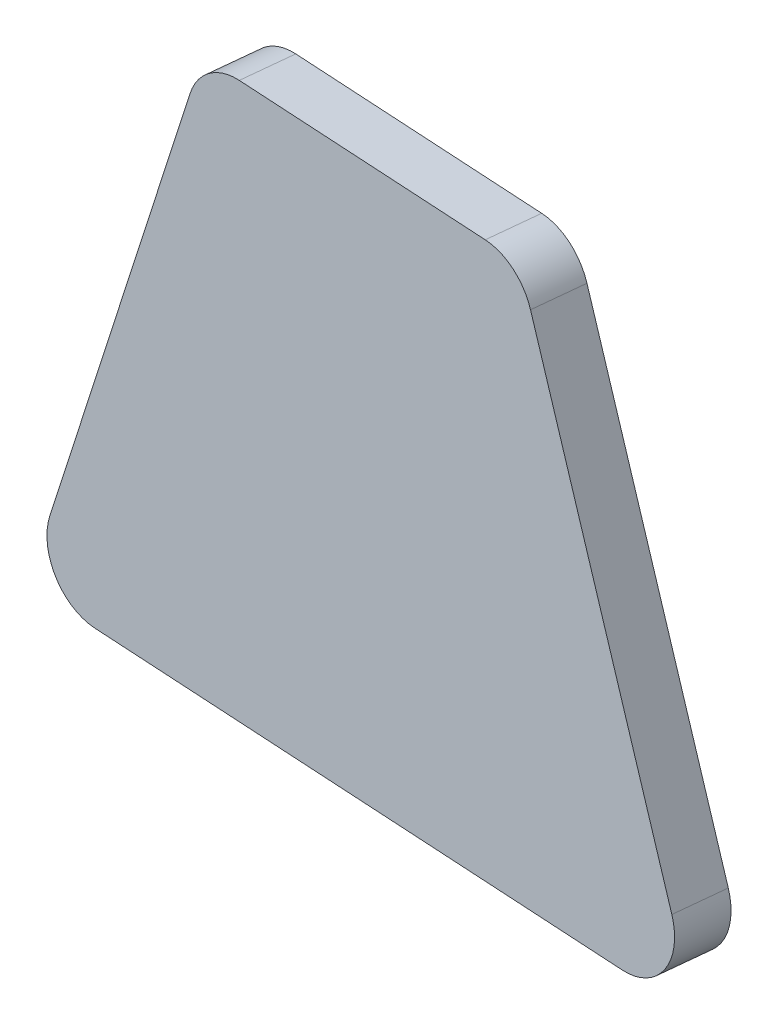
ISO-10303-21;
HEADER;
FILE_DESCRIPTION(('STEP AP214'),'2;1');
FILE_NAME('part.step','',(''),(''),'','','');
FILE_SCHEMA(('AUTOMOTIVE_DESIGN { 1 0 10303 214 1 1 1 1 }'));
ENDSEC;
DATA;
#1=APPLICATION_CONTEXT('core data for automotive mechanical design processes');
#2=APPLICATION_PROTOCOL_DEFINITION('international standard','automotive_design',2000,#1);
#3=PRODUCT_CONTEXT('',#1,'mechanical');
#4=PRODUCT('Part','Part','',(#3));
#5=PRODUCT_RELATED_PRODUCT_CATEGORY('part','',(#4));
#6=PRODUCT_DEFINITION_FORMATION('','',#4);
#7=PRODUCT_DEFINITION_CONTEXT('part definition',#1,'design');
#8=PRODUCT_DEFINITION('design','',#6,#7);
#9=PRODUCT_DEFINITION_SHAPE('','',#8);
#10=(LENGTH_UNIT() NAMED_UNIT(*) SI_UNIT(.MILLI.,.METRE.));
#11=(NAMED_UNIT(*) PLANE_ANGLE_UNIT() SI_UNIT($,.RADIAN.));
#12=(NAMED_UNIT(*) SI_UNIT($,.STERADIAN.) SOLID_ANGLE_UNIT());
#13=UNCERTAINTY_MEASURE_WITH_UNIT(LENGTH_MEASURE(1.E-05),#10,'distance_accuracy_value','');
#14=(GEOMETRIC_REPRESENTATION_CONTEXT(3) GLOBAL_UNCERTAINTY_ASSIGNED_CONTEXT((#13)) GLOBAL_UNIT_ASSIGNED_CONTEXT((#10,
#11,#12)) REPRESENTATION_CONTEXT('',''));
#15=CARTESIAN_POINT('',(0.,0.,0.));
#16=DIRECTION('',(0.,0.,1.));
#17=DIRECTION('',(1.,0.,0.));
#18=AXIS2_PLACEMENT_3D('',#15,#16,#17);
#19=CARTESIAN_POINT('',(-7.81574971739622,505.230219387593,117.441901297829));
#20=DIRECTION('',(0.,-0.999240415928223,0.0389691053989239));
#21=DIRECTION('',(0.,-0.0389691053989239,-0.999240415928223));
#22=AXIS2_PLACEMENT_3D('',#19,#20,#21);
#23=PLANE('',#22);
#24=DIRECTION('',(-0.998202841848732,-0.00233524994547634,-0.059880156419361));
#25=VECTOR('',#24,1.);
#26=CARTESIAN_POINT('',(-7.66353850287695,505.131415745339,114.90839195574));
#27=LINE('',#26,#25);
#28=CARTESIAN_POINT('',(6.65709224111823,505.164918206725,115.767457441254));
#29=VERTEX_POINT('',#28);
#30=CARTESIAN_POINT('',(-5.79189953125388,505.135794359207,115.020667767512));
#31=VERTEX_POINT('',#30);
#32=EDGE_CURVE('E129',#29,#31,#27,.T.);
#33=ORIENTED_EDGE('',*,*,#32,.T.);
#34=DIRECTION('',(0.0599256750075872,-0.0388990717535084,-0.997444622869661));
#35=VECTOR('',#34,1.);
#36=CARTESIAN_POINT('',(-5.94411074577315,505.234598001461,117.554177109601));
#37=LINE('',#36,#35);
#38=CARTESIAN_POINT('',(-5.94411074577315,505.234598001461,117.554177109601));
#39=VERTEX_POINT('',#38);
#40=EDGE_CURVE('E107',#31,#39,#37,.F.);
#41=ORIENTED_EDGE('',*,*,#40,.T.);
#42=DIRECTION('',(-0.998202841848732,-0.00233524994547634,-0.059880156419361));
#43=VECTOR('',#42,1.);
#44=CARTESIAN_POINT('',(-7.81574971739622,505.230219387593,117.441901297829));
#45=LINE('',#44,#43);
#46=CARTESIAN_POINT('',(6.50488102659895,505.263721848979,118.300966783343));
#47=VERTEX_POINT('',#46);
#48=EDGE_CURVE('E138',#47,#39,#45,.T.);
#49=ORIENTED_EDGE('',*,*,#48,.F.);
#50=DIRECTION('',(0.0599256750075872,-0.0388990717535084,-0.997444622869661));
#51=VECTOR('',#50,1.);
#52=CARTESIAN_POINT('',(6.50488102659895,505.263721848979,118.300966783343));
#53=LINE('',#52,#51);
#54=EDGE_CURVE('E112',#47,#29,#53,.T.);
#55=ORIENTED_EDGE('',*,*,#54,.T.);
#56=EDGE_LOOP('',(#33,#41,#49,#55));
#57=FACE_BOUND('',#56,.T.);
#58=ADVANCED_FACE('F36',(#57),#23,.F.);
#59=CARTESIAN_POINT('',(-15.6308234320114,479.831229815094,117.962906212137));
#60=DIRECTION('',(0.953915959752052,-0.29210332779981,0.068702166040079));
#61=DIRECTION('',(0.29279513981877,0.956175196341396,0.));
#62=AXIS2_PLACEMENT_3D('',#59,#60,#61);
#63=PLANE('',#62);
#64=DIRECTION('',(-0.294029344122669,-0.955595368398671,0.019601956274846));
#65=VECTOR('',#64,1.);
#66=CARTESIAN_POINT('',(-15.6308234320114,479.831229815094,117.962906212137));
#67=LINE('',#66,#65);
#68=CARTESIAN_POINT('',(-8.36705728354336,503.438469797615,117.478655135572));
#69=VERTEX_POINT('',#68);
#70=CARTESIAN_POINT('',(-14.6191162552355,483.119278139615,117.895459067018));
#71=VERTEX_POINT('',#70);
#72=EDGE_CURVE('E122',#69,#71,#67,.T.);
#73=ORIENTED_EDGE('',*,*,#72,.F.);
#74=DIRECTION('',(0.0599256750075872,-0.0388990717535084,-0.997444622869661));
#75=VECTOR('',#74,1.);
#76=CARTESIAN_POINT('',(-8.36705728354335,503.438469797615,117.478655135572));
#77=LINE('',#76,#75);
#78=CARTESIAN_POINT('',(-8.21484606902409,503.339666155361,114.945145793483));
#79=VERTEX_POINT('',#78);
#80=EDGE_CURVE('E106',#69,#79,#77,.T.);
#81=ORIENTED_EDGE('',*,*,#80,.T.);
#82=DIRECTION('',(-0.294029344122669,-0.955595368398671,0.019601956274846));
#83=VECTOR('',#82,1.);
#84=CARTESIAN_POINT('',(-15.4786122174922,479.73242617284,115.429396870048));
#85=LINE('',#84,#83);
#86=CARTESIAN_POINT('',(-14.4669050407163,483.020474497361,115.361949724929));
#87=VERTEX_POINT('',#86);
#88=EDGE_CURVE('E119',#79,#87,#85,.T.);
#89=ORIENTED_EDGE('',*,*,#88,.T.);
#90=DIRECTION('',(0.0599256750075872,-0.0388990717535084,-0.997444622869661));
#91=VECTOR('',#90,1.);
#92=CARTESIAN_POINT('',(-14.6191162552355,483.119278139615,117.895459067018));
#93=LINE('',#92,#91);
#94=EDGE_CURVE('E124',#87,#71,#93,.F.);
#95=ORIENTED_EDGE('',*,*,#94,.T.);
#96=EDGE_LOOP('',(#73,#81,#89,#95));
#97=FACE_BOUND('',#96,.T.);
#98=ADVANCED_FACE('F118',(#97),#63,.F.);
#99=CARTESIAN_POINT('',(18.2253387080043,479.910434759697,119.993868457194));
#100=DIRECTION('',(0.,0.999240415928223,-0.0389691053989237));
#101=DIRECTION('',(0.,0.0389691053989237,0.999240415928223));
#102=AXIS2_PLACEMENT_3D('',#99,#100,#101);
#103=PLANE('',#102);
#104=DIRECTION('',(0.998202841848732,0.00233524994547187,0.0598801564193607));
#105=VECTOR('',#104,1.);
#106=CARTESIAN_POINT('',(18.3775499225235,479.811631117443,117.460359115105));
#107=LINE('',#106,#105);
#108=CARTESIAN_POINT('',(-12.0439585029461,479.740461388292,115.635434754384));
#109=VERTEX_POINT('',#108);
#110=CARTESIAN_POINT('',(14.6527729347761,479.802917171847,117.236917326219));
#111=VERTEX_POINT('',#110);
#112=EDGE_CURVE('E128',#109,#111,#107,.T.);
#113=ORIENTED_EDGE('',*,*,#112,.T.);
#114=DIRECTION('',(0.0599256750075872,-0.0388990717535084,-0.997444622869661));
#115=VECTOR('',#114,1.);
#116=CARTESIAN_POINT('',(14.5005617202568,479.901720814101,119.770426668308));
#117=LINE('',#116,#115);
#118=CARTESIAN_POINT('',(14.5005617202568,479.901720814101,119.770426668308));
#119=VERTEX_POINT('',#118);
#120=EDGE_CURVE('E11',#111,#119,#117,.F.);
#121=ORIENTED_EDGE('',*,*,#120,.T.);
#122=DIRECTION('',(0.998202841848732,0.00233524994547187,0.0598801564193607));
#123=VECTOR('',#122,1.);
#124=CARTESIAN_POINT('',(18.2253387080043,479.910434759697,119.993868457194));
#125=LINE('',#124,#123);
#126=CARTESIAN_POINT('',(-12.1961697174653,479.839265030546,118.168944096473));
#127=VERTEX_POINT('',#126);
#128=EDGE_CURVE('E164',#127,#119,#125,.T.);
#129=ORIENTED_EDGE('',*,*,#128,.F.);
#130=DIRECTION('',(0.0599256750075872,-0.0388990717535084,-0.997444622869661));
#131=VECTOR('',#130,1.);
#132=CARTESIAN_POINT('',(-12.1961697174653,479.839265030546,118.168944096473));
#133=LINE('',#132,#131);
#134=EDGE_CURVE('E44',#127,#109,#133,.T.);
#135=ORIENTED_EDGE('',*,*,#134,.T.);
#136=EDGE_LOOP('',(#113,#121,#129,#135));
#137=FACE_BOUND('',#136,.T.);
#138=ADVANCED_FACE('F162',(#137),#103,.F.);
#139=CARTESIAN_POINT('',(8.23073784093191,505.26775941215,118.404497420271));
#140=DIRECTION('',(-0.92865480680805,-0.368625677005424,-0.0414169052996053));
#141=DIRECTION('',(0.368942247216484,-0.929452321649072,0.));
#142=AXIS2_PLACEMENT_3D('',#139,#140,#141);
#143=PLANE('',#142);
#144=DIRECTION('',(-0.366072620209691,0.928763679559558,-0.0582139524839453));
#145=VECTOR('',#144,1.);
#146=CARTESIAN_POINT('',(8.38294905545118,505.168955769896,115.870988078182));
#147=LINE('',#146,#145);
#148=CARTESIAN_POINT('',(17.0115561440686,483.277297047898,117.243134737967));
#149=VERTEX_POINT('',#148);
#150=CARTESIAN_POINT('',(9.01587545041068,503.563156769861,115.971637908428));
#151=VERTEX_POINT('',#150);
#152=EDGE_CURVE('E132',#149,#151,#147,.T.);
#153=ORIENTED_EDGE('',*,*,#152,.T.);
#154=DIRECTION('',(0.0599256750075872,-0.0388990717535084,-0.997444622869661));
#155=VECTOR('',#154,1.);
#156=CARTESIAN_POINT('',(8.86366423589141,503.661960412115,118.505147250517));
#157=LINE('',#156,#155);
#158=CARTESIAN_POINT('',(8.86366423589141,503.661960412115,118.505147250517));
#159=VERTEX_POINT('',#158);
#160=EDGE_CURVE('E51',#151,#159,#157,.F.);
#161=ORIENTED_EDGE('',*,*,#160,.T.);
#162=DIRECTION('',(-0.366072620209691,0.928763679559558,-0.0582139524839453));
#163=VECTOR('',#162,1.);
#164=CARTESIAN_POINT('',(8.23073784093191,505.26775941215,118.404497420271));
#165=LINE('',#164,#163);
#166=CARTESIAN_POINT('',(16.8593449295493,483.376100690152,119.776644080056));
#167=VERTEX_POINT('',#166);
#168=EDGE_CURVE('E139',#167,#159,#165,.T.);
#169=ORIENTED_EDGE('',*,*,#168,.F.);
#170=DIRECTION('',(0.0599256750075872,-0.0388990717535084,-0.997444622869661));
#171=VECTOR('',#170,1.);
#172=CARTESIAN_POINT('',(16.8593449295493,483.376100690152,119.776644080056));
#173=LINE('',#172,#171);
#174=EDGE_CURVE('E155',#167,#149,#173,.T.);
#175=ORIENTED_EDGE('',*,*,#174,.T.);
#176=EDGE_LOOP('',(#153,#161,#169,#175));
#177=FACE_BOUND('',#176,.T.);
#178=ADVANCED_FACE('F171',(#177),#143,.F.);
#179=CARTESIAN_POINT('',(-8.22558653285149,5.33940887133223,136.912384484664));
#180=DIRECTION('',(-0.0599256750075875,0.0388990717535087,0.997444622869661));
#181=DIRECTION('',(0.998200115924467,0.,0.0599710644259419));
#182=AXIS2_PLACEMENT_3D('',#179,#180,#181);
#183=PLANE('',#182);
#184=ORIENTED_EDGE('',*,*,#48,.T.);
#185=CARTESIAN_POINT('',(-5.94411074577314,502.696527345003,117.653158637314));
#186=DIRECTION('',(-0.0599256750075875,0.0388990717535087,0.997444622869661));
#187=DIRECTION('',(0.998200115924467,0.,0.0599710644259419));
#188=AXIS2_PLACEMENT_3D('',#185,#186,#187);
#189=CIRCLE('',#188,2.54);
#190=EDGE_CURVE('E153',#39,#69,#189,.T.);
#191=ORIENTED_EDGE('',*,*,#190,.T.);
#192=ORIENTED_EDGE('',*,*,#72,.T.);
#193=CARTESIAN_POINT('',(-12.1961697174653,482.377335687004,118.06996256876));
#194=DIRECTION('',(-0.0599256750075875,0.0388990717535087,0.997444622869661));
#195=DIRECTION('',(0.998200115924467,0.,0.0599710644259419));
#196=AXIS2_PLACEMENT_3D('',#193,#194,#195);
#197=CIRCLE('',#196,2.54);
#198=EDGE_CURVE('E148',#71,#127,#197,.T.);
#199=ORIENTED_EDGE('',*,*,#198,.T.);
#200=ORIENTED_EDGE('',*,*,#128,.T.);
#201=CARTESIAN_POINT('',(14.5005617202568,482.439791470559,119.671445140595));
#202=DIRECTION('',(-0.0599256750075875,0.0388990717535087,0.997444622869661));
#203=DIRECTION('',(0.998200115924467,0.,0.0599710644259419));
#204=AXIS2_PLACEMENT_3D('',#201,#202,#203);
#205=CIRCLE('',#204,2.54);
#206=EDGE_CURVE('E58',#119,#167,#205,.T.);
#207=ORIENTED_EDGE('',*,*,#206,.T.);
#208=ORIENTED_EDGE('',*,*,#168,.T.);
#209=CARTESIAN_POINT('',(6.50488102659896,502.725651192521,118.399948311056));
#210=DIRECTION('',(-0.0599256750075875,0.0388990717535087,0.997444622869661));
#211=DIRECTION('',(0.998200115924467,0.,0.0599710644259419));
#212=AXIS2_PLACEMENT_3D('',#209,#210,#211);
#213=CIRCLE('',#212,2.54);
#214=EDGE_CURVE('E151',#159,#47,#213,.T.);
#215=ORIENTED_EDGE('',*,*,#214,.T.);
#216=EDGE_LOOP('',(#184,#191,#192,#199,#200,#207,#208,#215));
#217=FACE_BOUND('',#216,.T.);
#218=ADVANCED_FACE('F178',(#217),#183,.T.);
#219=CARTESIAN_POINT('',(-8.07337531833222,5.24060522907832,134.378875142575));
#220=DIRECTION('',(-0.0599256750075875,0.0388990717535087,0.997444622869661));
#221=DIRECTION('',(0.998200115924467,0.,0.0599710644259419));
#222=AXIS2_PLACEMENT_3D('',#219,#220,#221);
#223=PLANE('',#222);
#224=ORIENTED_EDGE('',*,*,#88,.F.);
#225=CARTESIAN_POINT('',(-5.79189953125387,502.597723702749,115.119649295225));
#226=DIRECTION('',(-0.0599256750075875,0.0388990717535087,0.997444622869661));
#227=DIRECTION('',(0.998200115924467,0.,0.0599710644259419));
#228=AXIS2_PLACEMENT_3D('',#225,#226,#227);
#229=CIRCLE('',#228,2.54);
#230=EDGE_CURVE('E102',#79,#31,#229,.F.);
#231=ORIENTED_EDGE('',*,*,#230,.T.);
#232=ORIENTED_EDGE('',*,*,#32,.F.);
#233=CARTESIAN_POINT('',(6.65709224111823,502.626847550267,115.866438968967));
#234=DIRECTION('',(-0.0599256750075875,0.0388990717535087,0.997444622869661));
#235=DIRECTION('',(0.998200115924467,0.,0.0599710644259419));
#236=AXIS2_PLACEMENT_3D('',#233,#234,#235);
#237=CIRCLE('',#236,2.54);
#238=EDGE_CURVE('E113',#29,#151,#237,.F.);
#239=ORIENTED_EDGE('',*,*,#238,.T.);
#240=ORIENTED_EDGE('',*,*,#152,.F.);
#241=CARTESIAN_POINT('',(14.6527729347761,482.340987828305,117.137935798506));
#242=DIRECTION('',(-0.0599256750075875,0.0388990717535087,0.997444622869661));
#243=DIRECTION('',(0.998200115924467,0.,0.0599710644259419));
#244=AXIS2_PLACEMENT_3D('',#241,#242,#243);
#245=CIRCLE('',#244,2.54);
#246=EDGE_CURVE('E142',#149,#111,#245,.F.);
#247=ORIENTED_EDGE('',*,*,#246,.T.);
#248=ORIENTED_EDGE('',*,*,#112,.F.);
#249=CARTESIAN_POINT('',(-12.043958502946,482.27853204475,115.536453226671));
#250=DIRECTION('',(-0.0599256750075875,0.0388990717535087,0.997444622869661));
#251=DIRECTION('',(0.998200115924467,0.,0.0599710644259419));
#252=AXIS2_PLACEMENT_3D('',#249,#250,#251);
#253=CIRCLE('',#252,2.54);
#254=EDGE_CURVE('E123',#109,#87,#253,.F.);
#255=ORIENTED_EDGE('',*,*,#254,.T.);
#256=EDGE_LOOP('',(#224,#231,#232,#239,#240,#247,#248,#255));
#257=FACE_BOUND('',#256,.T.);
#258=ADVANCED_FACE('F126',(#257),#223,.F.);
#259=CARTESIAN_POINT('',(-5.94411074577314,502.696527345003,117.653158637314));
#260=DIRECTION('',(0.0599256750075872,-0.0388990717535084,-0.997444622869661));
#261=DIRECTION('',(-0.998200115924467,0.,-0.0599710644259416));
#262=AXIS2_PLACEMENT_3D('',#259,#260,#261);
#263=CYLINDRICAL_SURFACE('',#262,2.54);
#264=ORIENTED_EDGE('',*,*,#190,.F.);
#265=ORIENTED_EDGE('',*,*,#40,.F.);
#266=ORIENTED_EDGE('',*,*,#230,.F.);
#267=ORIENTED_EDGE('',*,*,#80,.F.);
#268=EDGE_LOOP('',(#264,#265,#266,#267));
#269=FACE_BOUND('',#268,.T.);
#270=ADVANCED_FACE('F105',(#269),#263,.T.);
#271=CARTESIAN_POINT('',(6.50488102659896,502.725651192521,118.399948311056));
#272=DIRECTION('',(0.0599256750075872,-0.0388990717535084,-0.997444622869661));
#273=DIRECTION('',(-0.998200115924467,0.,-0.0599710644259416));
#274=AXIS2_PLACEMENT_3D('',#271,#272,#273);
#275=CYLINDRICAL_SURFACE('',#274,2.54);
#276=ORIENTED_EDGE('',*,*,#214,.F.);
#277=ORIENTED_EDGE('',*,*,#160,.F.);
#278=ORIENTED_EDGE('',*,*,#238,.F.);
#279=ORIENTED_EDGE('',*,*,#54,.F.);
#280=EDGE_LOOP('',(#276,#277,#278,#279));
#281=FACE_BOUND('',#280,.T.);
#282=ADVANCED_FACE('F182',(#281),#275,.T.);
#283=CARTESIAN_POINT('',(14.5005617202568,482.439791470559,119.671445140595));
#284=DIRECTION('',(0.0599256750075872,-0.0388990717535084,-0.997444622869661));
#285=DIRECTION('',(-0.998200115924467,0.,-0.0599710644259416));
#286=AXIS2_PLACEMENT_3D('',#283,#284,#285);
#287=CYLINDRICAL_SURFACE('',#286,2.54);
#288=ORIENTED_EDGE('',*,*,#206,.F.);
#289=ORIENTED_EDGE('',*,*,#120,.F.);
#290=ORIENTED_EDGE('',*,*,#246,.F.);
#291=ORIENTED_EDGE('',*,*,#174,.F.);
#292=EDGE_LOOP('',(#288,#289,#290,#291));
#293=FACE_BOUND('',#292,.T.);
#294=ADVANCED_FACE('F170',(#293),#287,.T.);
#295=CARTESIAN_POINT('',(-12.1961697174653,482.377335687004,118.06996256876));
#296=DIRECTION('',(0.0599256750075872,-0.0388990717535084,-0.997444622869661));
#297=DIRECTION('',(-0.998200115924467,0.,-0.0599710644259416));
#298=AXIS2_PLACEMENT_3D('',#295,#296,#297);
#299=CYLINDRICAL_SURFACE('',#298,2.54);
#300=ORIENTED_EDGE('',*,*,#198,.F.);
#301=ORIENTED_EDGE('',*,*,#94,.F.);
#302=ORIENTED_EDGE('',*,*,#254,.F.);
#303=ORIENTED_EDGE('',*,*,#134,.F.);
#304=EDGE_LOOP('',(#300,#301,#302,#303));
#305=FACE_BOUND('',#304,.T.);
#306=ADVANCED_FACE('F38',(#305),#299,.T.);
#307=CLOSED_SHELL('',(#58,#98,#138,#178,#218,#258,#270,#282,#294,#306));
#308=MANIFOLD_SOLID_BREP('B2',#307);
#309=ADVANCED_BREP_SHAPE_REPRESENTATION('',(#18,#308),#14);
#310=SHAPE_DEFINITION_REPRESENTATION(#9,#309);
ENDSEC;
END-ISO-10303-21;
